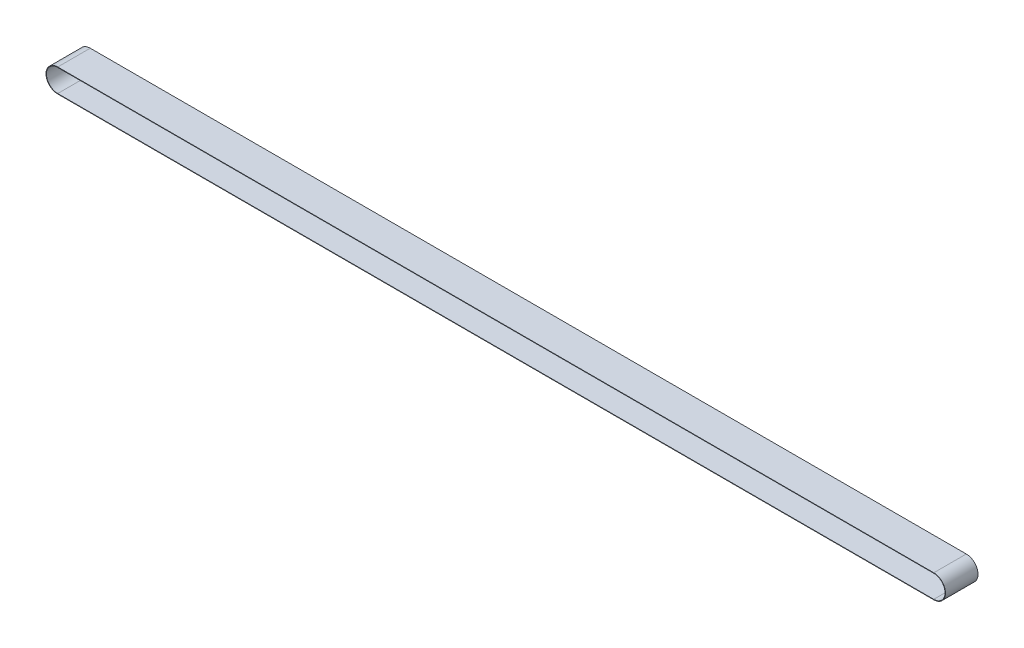
ISO-10303-21;
HEADER;
FILE_DESCRIPTION(('STEP AP214'),'2;1');
FILE_NAME('part.step','',(''),(''),'','','');
FILE_SCHEMA(('AUTOMOTIVE_DESIGN { 1 0 10303 214 1 1 1 1 }'));
ENDSEC;
DATA;
#1=APPLICATION_CONTEXT('core data for automotive mechanical design processes');
#2=APPLICATION_PROTOCOL_DEFINITION('international standard','automotive_design',2000,#1);
#3=PRODUCT_CONTEXT('',#1,'mechanical');
#4=PRODUCT('Part','Part','',(#3));
#5=PRODUCT_RELATED_PRODUCT_CATEGORY('part','',(#4));
#6=PRODUCT_DEFINITION_FORMATION('','',#4);
#7=PRODUCT_DEFINITION_CONTEXT('part definition',#1,'design');
#8=PRODUCT_DEFINITION('design','',#6,#7);
#9=PRODUCT_DEFINITION_SHAPE('','',#8);
#10=(LENGTH_UNIT() NAMED_UNIT(*) SI_UNIT(.MILLI.,.METRE.));
#11=(NAMED_UNIT(*) PLANE_ANGLE_UNIT() SI_UNIT($,.RADIAN.));
#12=(NAMED_UNIT(*) SI_UNIT($,.STERADIAN.) SOLID_ANGLE_UNIT());
#13=UNCERTAINTY_MEASURE_WITH_UNIT(LENGTH_MEASURE(1.E-05),#10,'distance_accuracy_value','');
#14=(GEOMETRIC_REPRESENTATION_CONTEXT(3) GLOBAL_UNCERTAINTY_ASSIGNED_CONTEXT((#13)) GLOBAL_UNIT_ASSIGNED_CONTEXT((#10,
#11,#12)) REPRESENTATION_CONTEXT('',''));
#15=CARTESIAN_POINT('',(0.,0.,0.));
#16=DIRECTION('',(0.,0.,1.));
#17=DIRECTION('',(1.,0.,0.));
#18=AXIS2_PLACEMENT_3D('',#15,#16,#17);
#19=CARTESIAN_POINT('',(-1010.,1.21240033115588E-13,37.5));
#20=DIRECTION('',(0.,0.,1.));
#21=DIRECTION('',(1.,0.,0.));
#22=AXIS2_PLACEMENT_3D('',#19,#20,#21);
#23=PLANE('',#22);
#24=CARTESIAN_POINT('',(-1010.,1.21240033115588E-13,37.5));
#25=DIRECTION('',(0.,0.,1.));
#26=DIRECTION('',(1.,0.,0.));
#27=AXIS2_PLACEMENT_3D('',#24,#25,#26);
#28=CIRCLE('',#27,27.);
#29=CARTESIAN_POINT('',(-1010.,27.0000000000001,37.5));
#30=VERTEX_POINT('',#29);
#31=CARTESIAN_POINT('',(-1010.,-26.9999999999999,37.5));
#32=VERTEX_POINT('',#31);
#33=EDGE_CURVE('E159',#30,#32,#28,.T.);
#34=ORIENTED_EDGE('',*,*,#33,.T.);
#35=DIRECTION('',(1.,0.,0.));
#36=VECTOR('',#35,1.);
#37=CARTESIAN_POINT('',(-1010.,-26.9999999999999,37.5));
#38=LINE('',#37,#36);
#39=CARTESIAN_POINT('',(1010.,-26.9999999999999,37.5));
#40=VERTEX_POINT('',#39);
#41=EDGE_CURVE('E162',#32,#40,#38,.T.);
#42=ORIENTED_EDGE('',*,*,#41,.T.);
#43=CARTESIAN_POINT('',(1010.,1.20634022328381E-13,37.5));
#44=DIRECTION('',(0.,0.,1.));
#45=DIRECTION('',(1.,0.,0.));
#46=AXIS2_PLACEMENT_3D('',#43,#44,#45);
#47=CIRCLE('',#46,27.);
#48=CARTESIAN_POINT('',(1010.,27.0000000000001,37.5));
#49=VERTEX_POINT('',#48);
#50=EDGE_CURVE('E165',#40,#49,#47,.T.);
#51=ORIENTED_EDGE('',*,*,#50,.T.);
#52=DIRECTION('',(1.,0.,0.));
#53=VECTOR('',#52,1.);
#54=CARTESIAN_POINT('',(-1010.,27.0000000000001,37.5));
#55=LINE('',#54,#53);
#56=EDGE_CURVE('E167',#30,#49,#55,.T.);
#57=ORIENTED_EDGE('',*,*,#56,.F.);
#58=EDGE_LOOP('',(#34,#42,#51,#57));
#59=FACE_BOUND('',#58,.T.);
#60=DIRECTION('',(1.,0.,0.));
#61=VECTOR('',#60,1.);
#62=CARTESIAN_POINT('',(-1010.,-25.9999999999999,37.5));
#63=LINE('',#62,#61);
#64=CARTESIAN_POINT('',(-1010.,-25.9999999999999,37.5));
#65=VERTEX_POINT('',#64);
#66=CARTESIAN_POINT('',(1010.,-25.9999999999999,37.5));
#67=VERTEX_POINT('',#66);
#68=EDGE_CURVE('E132',#65,#67,#63,.T.);
#69=ORIENTED_EDGE('',*,*,#68,.F.);
#70=CARTESIAN_POINT('',(-1010.,1.21240033115588E-13,37.5));
#71=DIRECTION('',(0.,0.,1.));
#72=DIRECTION('',(1.,0.,0.));
#73=AXIS2_PLACEMENT_3D('',#70,#71,#72);
#74=CIRCLE('',#73,26.);
#75=CARTESIAN_POINT('',(-1010.,26.0000000000001,37.5));
#76=VERTEX_POINT('',#75);
#77=EDGE_CURVE('E124',#76,#65,#74,.T.);
#78=ORIENTED_EDGE('',*,*,#77,.F.);
#79=DIRECTION('',(1.,0.,0.));
#80=VECTOR('',#79,1.);
#81=CARTESIAN_POINT('',(-1010.,26.0000000000001,37.5));
#82=LINE('',#81,#80);
#83=CARTESIAN_POINT('',(1010.,26.0000000000001,37.5));
#84=VERTEX_POINT('',#83);
#85=EDGE_CURVE('E146',#76,#84,#82,.T.);
#86=ORIENTED_EDGE('',*,*,#85,.T.);
#87=CARTESIAN_POINT('',(1010.,1.20634022328381E-13,37.5));
#88=DIRECTION('',(0.,0.,1.));
#89=DIRECTION('',(1.,0.,0.));
#90=AXIS2_PLACEMENT_3D('',#87,#88,#89);
#91=CIRCLE('',#90,26.);
#92=EDGE_CURVE('E144',#67,#84,#91,.T.);
#93=ORIENTED_EDGE('',*,*,#92,.F.);
#94=EDGE_LOOP('',(#69,#78,#86,#93));
#95=FACE_BOUND('',#94,.T.);
#96=ADVANCED_FACE('F59',(#59,#95),#23,.T.);
#97=CARTESIAN_POINT('',(-1010.,1.21240033115588E-13,-37.5));
#98=DIRECTION('',(0.,0.,1.));
#99=DIRECTION('',(1.,0.,0.));
#100=AXIS2_PLACEMENT_3D('',#97,#98,#99);
#101=PLANE('',#100);
#102=CARTESIAN_POINT('',(-1010.,1.21240033115588E-13,-37.5));
#103=DIRECTION('',(0.,0.,1.));
#104=DIRECTION('',(1.,0.,0.));
#105=AXIS2_PLACEMENT_3D('',#102,#103,#104);
#106=CIRCLE('',#105,27.);
#107=CARTESIAN_POINT('',(-1010.,27.0000000000001,-37.5));
#108=VERTEX_POINT('',#107);
#109=CARTESIAN_POINT('',(-1010.,-26.9999999999999,-37.5));
#110=VERTEX_POINT('',#109);
#111=EDGE_CURVE('E140',#108,#110,#106,.T.);
#112=ORIENTED_EDGE('',*,*,#111,.F.);
#113=DIRECTION('',(1.,0.,0.));
#114=VECTOR('',#113,1.);
#115=CARTESIAN_POINT('',(-1010.,27.0000000000001,-37.5));
#116=LINE('',#115,#114);
#117=CARTESIAN_POINT('',(1010.,27.0000000000001,-37.5));
#118=VERTEX_POINT('',#117);
#119=EDGE_CURVE('E163',#108,#118,#116,.T.);
#120=ORIENTED_EDGE('',*,*,#119,.T.);
#121=CARTESIAN_POINT('',(1010.,1.20634022328381E-13,-37.5));
#122=DIRECTION('',(0.,0.,1.));
#123=DIRECTION('',(1.,0.,0.));
#124=AXIS2_PLACEMENT_3D('',#121,#122,#123);
#125=CIRCLE('',#124,27.);
#126=CARTESIAN_POINT('',(1010.,-26.9999999999999,-37.5));
#127=VERTEX_POINT('',#126);
#128=EDGE_CURVE('E175',#127,#118,#125,.T.);
#129=ORIENTED_EDGE('',*,*,#128,.F.);
#130=DIRECTION('',(1.,0.,0.));
#131=VECTOR('',#130,1.);
#132=CARTESIAN_POINT('',(-1010.,-26.9999999999999,-37.5));
#133=LINE('',#132,#131);
#134=EDGE_CURVE('E173',#110,#127,#133,.T.);
#135=ORIENTED_EDGE('',*,*,#134,.F.);
#136=EDGE_LOOP('',(#112,#120,#129,#135));
#137=FACE_BOUND('',#136,.T.);
#138=CARTESIAN_POINT('',(-1010.,1.21240033115588E-13,-37.5));
#139=DIRECTION('',(0.,0.,1.));
#140=DIRECTION('',(1.,0.,0.));
#141=AXIS2_PLACEMENT_3D('',#138,#139,#140);
#142=CIRCLE('',#141,26.);
#143=CARTESIAN_POINT('',(-1010.,26.0000000000001,-37.5));
#144=VERTEX_POINT('',#143);
#145=CARTESIAN_POINT('',(-1010.,-25.9999999999999,-37.5));
#146=VERTEX_POINT('',#145);
#147=EDGE_CURVE('E82',#144,#146,#142,.T.);
#148=ORIENTED_EDGE('',*,*,#147,.T.);
#149=DIRECTION('',(1.,0.,0.));
#150=VECTOR('',#149,1.);
#151=CARTESIAN_POINT('',(-1010.,-25.9999999999999,-37.5));
#152=LINE('',#151,#150);
#153=CARTESIAN_POINT('',(1010.,-25.9999999999999,-37.5));
#154=VERTEX_POINT('',#153);
#155=EDGE_CURVE('E139',#146,#154,#152,.T.);
#156=ORIENTED_EDGE('',*,*,#155,.T.);
#157=CARTESIAN_POINT('',(1010.,1.20634022328381E-13,-37.5));
#158=DIRECTION('',(0.,0.,1.));
#159=DIRECTION('',(1.,0.,0.));
#160=AXIS2_PLACEMENT_3D('',#157,#158,#159);
#161=CIRCLE('',#160,26.);
#162=CARTESIAN_POINT('',(1010.,26.0000000000001,-37.5));
#163=VERTEX_POINT('',#162);
#164=EDGE_CURVE('E152',#154,#163,#161,.T.);
#165=ORIENTED_EDGE('',*,*,#164,.T.);
#166=DIRECTION('',(1.,0.,0.));
#167=VECTOR('',#166,1.);
#168=CARTESIAN_POINT('',(-1010.,26.0000000000001,-37.5));
#169=LINE('',#168,#167);
#170=EDGE_CURVE('E133',#144,#163,#169,.T.);
#171=ORIENTED_EDGE('',*,*,#170,.F.);
#172=EDGE_LOOP('',(#148,#156,#165,#171));
#173=FACE_BOUND('',#172,.T.);
#174=ADVANCED_FACE('F192',(#137,#173),#101,.F.);
#175=CARTESIAN_POINT('',(-1010.,1.21240033115588E-13,37.5));
#176=DIRECTION('',(0.,0.,-1.));
#177=DIRECTION('',(-1.,0.,0.));
#178=AXIS2_PLACEMENT_3D('',#175,#176,#177);
#179=CYLINDRICAL_SURFACE('',#178,27.);
#180=ORIENTED_EDGE('',*,*,#111,.T.);
#181=DIRECTION('',(0.,0.,-1.));
#182=VECTOR('',#181,1.);
#183=CARTESIAN_POINT('',(-1010.,-26.9999999999999,37.5));
#184=LINE('',#183,#182);
#185=EDGE_CURVE('E12',#32,#110,#184,.T.);
#186=ORIENTED_EDGE('',*,*,#185,.F.);
#187=ORIENTED_EDGE('',*,*,#33,.F.);
#188=DIRECTION('',(0.,0.,-1.));
#189=VECTOR('',#188,1.);
#190=CARTESIAN_POINT('',(-1010.,27.0000000000001,37.5));
#191=LINE('',#190,#189);
#192=EDGE_CURVE('E170',#30,#108,#191,.T.);
#193=ORIENTED_EDGE('',*,*,#192,.T.);
#194=EDGE_LOOP('',(#180,#186,#187,#193));
#195=FACE_BOUND('',#194,.T.);
#196=ADVANCED_FACE('F61',(#195),#179,.T.);
#197=CARTESIAN_POINT('',(-1010.,-26.9999999999999,37.5));
#198=DIRECTION('',(0.,1.,0.));
#199=DIRECTION('',(0.,0.,1.));
#200=AXIS2_PLACEMENT_3D('',#197,#198,#199);
#201=PLANE('',#200);
#202=ORIENTED_EDGE('',*,*,#134,.T.);
#203=DIRECTION('',(0.,0.,-1.));
#204=VECTOR('',#203,1.);
#205=CARTESIAN_POINT('',(1010.,-26.9999999999999,37.5));
#206=LINE('',#205,#204);
#207=EDGE_CURVE('E67',#40,#127,#206,.T.);
#208=ORIENTED_EDGE('',*,*,#207,.F.);
#209=ORIENTED_EDGE('',*,*,#41,.F.);
#210=ORIENTED_EDGE('',*,*,#185,.T.);
#211=EDGE_LOOP('',(#202,#208,#209,#210));
#212=FACE_BOUND('',#211,.T.);
#213=ADVANCED_FACE('F201',(#212),#201,.F.);
#214=CARTESIAN_POINT('',(1010.,1.20634022328381E-13,37.5));
#215=DIRECTION('',(0.,0.,-1.));
#216=DIRECTION('',(-1.,0.,0.));
#217=AXIS2_PLACEMENT_3D('',#214,#215,#216);
#218=CYLINDRICAL_SURFACE('',#217,27.);
#219=ORIENTED_EDGE('',*,*,#128,.T.);
#220=DIRECTION('',(0.,0.,-1.));
#221=VECTOR('',#220,1.);
#222=CARTESIAN_POINT('',(1010.,27.0000000000001,37.5));
#223=LINE('',#222,#221);
#224=EDGE_CURVE('E181',#49,#118,#223,.T.);
#225=ORIENTED_EDGE('',*,*,#224,.F.);
#226=ORIENTED_EDGE('',*,*,#50,.F.);
#227=ORIENTED_EDGE('',*,*,#207,.T.);
#228=EDGE_LOOP('',(#219,#225,#226,#227));
#229=FACE_BOUND('',#228,.T.);
#230=ADVANCED_FACE('F187',(#229),#218,.T.);
#231=CARTESIAN_POINT('',(-1010.,27.0000000000001,37.5));
#232=DIRECTION('',(0.,1.,0.));
#233=DIRECTION('',(0.,0.,1.));
#234=AXIS2_PLACEMENT_3D('',#231,#232,#233);
#235=PLANE('',#234);
#236=ORIENTED_EDGE('',*,*,#119,.F.);
#237=ORIENTED_EDGE('',*,*,#192,.F.);
#238=ORIENTED_EDGE('',*,*,#56,.T.);
#239=ORIENTED_EDGE('',*,*,#224,.T.);
#240=EDGE_LOOP('',(#236,#237,#238,#239));
#241=FACE_BOUND('',#240,.T.);
#242=ADVANCED_FACE('F196',(#241),#235,.T.);
#243=CARTESIAN_POINT('',(-1010.,1.21240033115588E-13,37.5));
#244=DIRECTION('',(0.,0.,-1.));
#245=DIRECTION('',(-1.,0.,0.));
#246=AXIS2_PLACEMENT_3D('',#243,#244,#245);
#247=CYLINDRICAL_SURFACE('',#246,26.);
#248=ORIENTED_EDGE('',*,*,#147,.F.);
#249=DIRECTION('',(0.,0.,-1.));
#250=VECTOR('',#249,1.);
#251=CARTESIAN_POINT('',(-1010.,26.0000000000001,37.5));
#252=LINE('',#251,#250);
#253=EDGE_CURVE('E128',#76,#144,#252,.T.);
#254=ORIENTED_EDGE('',*,*,#253,.F.);
#255=ORIENTED_EDGE('',*,*,#77,.T.);
#256=DIRECTION('',(0.,0.,-1.));
#257=VECTOR('',#256,1.);
#258=CARTESIAN_POINT('',(-1010.,-25.9999999999999,37.5));
#259=LINE('',#258,#257);
#260=EDGE_CURVE('E127',#65,#146,#259,.T.);
#261=ORIENTED_EDGE('',*,*,#260,.T.);
#262=EDGE_LOOP('',(#248,#254,#255,#261));
#263=FACE_BOUND('',#262,.T.);
#264=ADVANCED_FACE('F126',(#263),#247,.F.);
#265=CARTESIAN_POINT('',(-1010.,-25.9999999999999,37.5));
#266=DIRECTION('',(0.,1.,0.));
#267=DIRECTION('',(0.,0.,1.));
#268=AXIS2_PLACEMENT_3D('',#265,#266,#267);
#269=PLANE('',#268);
#270=ORIENTED_EDGE('',*,*,#155,.F.);
#271=ORIENTED_EDGE('',*,*,#260,.F.);
#272=ORIENTED_EDGE('',*,*,#68,.T.);
#273=DIRECTION('',(0.,0.,-1.));
#274=VECTOR('',#273,1.);
#275=CARTESIAN_POINT('',(1010.,-25.9999999999999,37.5));
#276=LINE('',#275,#274);
#277=EDGE_CURVE('E141',#67,#154,#276,.T.);
#278=ORIENTED_EDGE('',*,*,#277,.T.);
#279=EDGE_LOOP('',(#270,#271,#272,#278));
#280=FACE_BOUND('',#279,.T.);
#281=ADVANCED_FACE('F136',(#280),#269,.T.);
#282=CARTESIAN_POINT('',(1010.,1.20634022328381E-13,37.5));
#283=DIRECTION('',(0.,0.,-1.));
#284=DIRECTION('',(-1.,0.,0.));
#285=AXIS2_PLACEMENT_3D('',#282,#283,#284);
#286=CYLINDRICAL_SURFACE('',#285,26.);
#287=ORIENTED_EDGE('',*,*,#164,.F.);
#288=ORIENTED_EDGE('',*,*,#277,.F.);
#289=ORIENTED_EDGE('',*,*,#92,.T.);
#290=DIRECTION('',(0.,0.,-1.));
#291=VECTOR('',#290,1.);
#292=CARTESIAN_POINT('',(1010.,26.0000000000001,37.5));
#293=LINE('',#292,#291);
#294=EDGE_CURVE('E74',#84,#163,#293,.T.);
#295=ORIENTED_EDGE('',*,*,#294,.T.);
#296=EDGE_LOOP('',(#287,#288,#289,#295));
#297=FACE_BOUND('',#296,.T.);
#298=ADVANCED_FACE('F238',(#297),#286,.F.);
#299=CARTESIAN_POINT('',(-1010.,26.0000000000001,37.5));
#300=DIRECTION('',(0.,1.,0.));
#301=DIRECTION('',(0.,0.,1.));
#302=AXIS2_PLACEMENT_3D('',#299,#300,#301);
#303=PLANE('',#302);
#304=ORIENTED_EDGE('',*,*,#170,.T.);
#305=ORIENTED_EDGE('',*,*,#294,.F.);
#306=ORIENTED_EDGE('',*,*,#85,.F.);
#307=ORIENTED_EDGE('',*,*,#253,.T.);
#308=EDGE_LOOP('',(#304,#305,#306,#307));
#309=FACE_BOUND('',#308,.T.);
#310=ADVANCED_FACE('F244',(#309),#303,.F.);
#311=CLOSED_SHELL('',(#96,#174,#196,#213,#230,#242,#264,#281,#298,#310));
#312=MANIFOLD_SOLID_BREP('B2',#311);
#313=ADVANCED_BREP_SHAPE_REPRESENTATION('',(#18,#312),#14);
#314=SHAPE_DEFINITION_REPRESENTATION(#9,#313);
ENDSEC;
END-ISO-10303-21;
